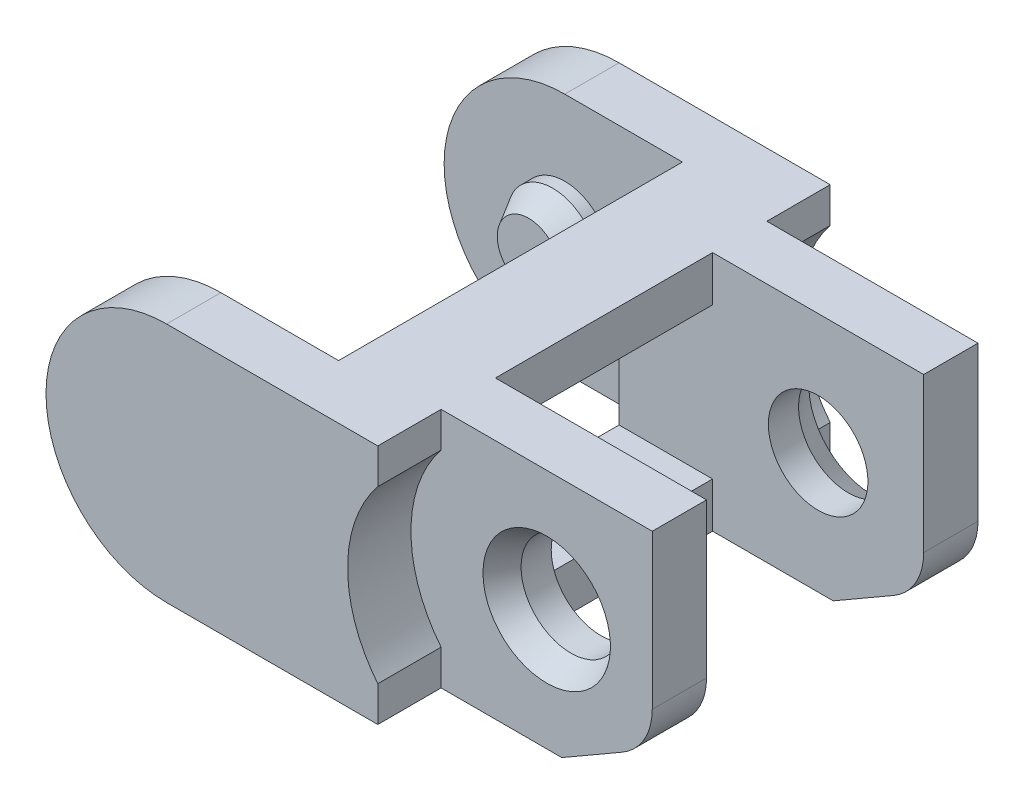
ISO-10303-21;
HEADER;
FILE_DESCRIPTION(('STEP AP214'),'2;1');
FILE_NAME('part.step','',(''),(''),'','','');
FILE_SCHEMA(('AUTOMOTIVE_DESIGN { 1 0 10303 214 1 1 1 1 }'));
ENDSEC;
DATA;
#1=APPLICATION_CONTEXT('core data for automotive mechanical design processes');
#2=APPLICATION_PROTOCOL_DEFINITION('international standard','automotive_design',2000,#1);
#3=PRODUCT_CONTEXT('',#1,'mechanical');
#4=PRODUCT('Part','Part','',(#3));
#5=PRODUCT_RELATED_PRODUCT_CATEGORY('part','',(#4));
#6=PRODUCT_DEFINITION_FORMATION('','',#4);
#7=PRODUCT_DEFINITION_CONTEXT('part definition',#1,'design');
#8=PRODUCT_DEFINITION('design','',#6,#7);
#9=PRODUCT_DEFINITION_SHAPE('','',#8);
#10=(LENGTH_UNIT() NAMED_UNIT(*) SI_UNIT(.MILLI.,.METRE.));
#11=(NAMED_UNIT(*) PLANE_ANGLE_UNIT() SI_UNIT($,.RADIAN.));
#12=(NAMED_UNIT(*) SI_UNIT($,.STERADIAN.) SOLID_ANGLE_UNIT());
#13=UNCERTAINTY_MEASURE_WITH_UNIT(LENGTH_MEASURE(1.E-05),#10,'distance_accuracy_value','');
#14=(GEOMETRIC_REPRESENTATION_CONTEXT(3) GLOBAL_UNCERTAINTY_ASSIGNED_CONTEXT((#13)) GLOBAL_UNIT_ASSIGNED_CONTEXT((#10,
#11,#12)) REPRESENTATION_CONTEXT('',''));
#15=CARTESIAN_POINT('',(0.,0.,0.));
#16=DIRECTION('',(0.,0.,1.));
#17=DIRECTION('',(1.,0.,0.));
#18=AXIS2_PLACEMENT_3D('',#15,#16,#17);
#19=CARTESIAN_POINT('',(0.,-8.,-5.4));
#20=DIRECTION('',(-1.,0.,0.));
#21=DIRECTION('',(0.,0.,1.));
#22=AXIS2_PLACEMENT_3D('',#19,#20,#21);
#23=PLANE('',#22);
#24=DIRECTION('',(0.,0.,-1.));
#25=VECTOR('',#24,1.);
#26=CARTESIAN_POINT('',(0.,-1.17157287525381,-5.4));
#27=LINE('',#26,#25);
#28=CARTESIAN_POINT('',(0.,-1.17157287525381,-7.5));
#29=VERTEX_POINT('',#28);
#30=CARTESIAN_POINT('',(0.,-1.17157287525381,-5.4));
#31=VERTEX_POINT('',#30);
#32=EDGE_CURVE('E223',#29,#31,#27,.F.);
#33=ORIENTED_EDGE('',*,*,#32,.F.);
#34=DIRECTION('',(0.,1.,0.));
#35=VECTOR('',#34,1.);
#36=CARTESIAN_POINT('',(0.,-8.,-7.5));
#37=LINE('',#36,#35);
#38=CARTESIAN_POINT('',(0.,0.,-7.5));
#39=VERTEX_POINT('',#38);
#40=EDGE_CURVE('E250',#29,#39,#37,.T.);
#41=ORIENTED_EDGE('',*,*,#40,.T.);
#42=DIRECTION('',(0.,0.,-1.));
#43=VECTOR('',#42,1.);
#44=CARTESIAN_POINT('',(0.,0.,7.5));
#45=LINE('',#44,#43);
#46=CARTESIAN_POINT('',(0.,0.,-5.4));
#47=VERTEX_POINT('',#46);
#48=EDGE_CURVE('E274',#47,#39,#45,.T.);
#49=ORIENTED_EDGE('',*,*,#48,.F.);
#50=DIRECTION('',(0.,1.,0.));
#51=VECTOR('',#50,1.);
#52=CARTESIAN_POINT('',(0.,-8.,-5.4));
#53=LINE('',#52,#51);
#54=EDGE_CURVE('E243',#31,#47,#53,.T.);
#55=ORIENTED_EDGE('',*,*,#54,.F.);
#56=EDGE_LOOP('',(#33,#41,#49,#55));
#57=FACE_BOUND('',#56,.T.);
#58=ADVANCED_FACE('F32',(#57),#23,.F.);
#59=DIRECTION('',(0.,0.,-1.));
#60=VECTOR('',#59,1.);
#61=CARTESIAN_POINT('',(0.,-6.82842712474619,-5.4));
#62=LINE('',#61,#60);
#63=CARTESIAN_POINT('',(0.,-6.82842712474619,-5.4));
#64=VERTEX_POINT('',#63);
#65=CARTESIAN_POINT('',(0.,-6.82842712474619,-7.5));
#66=VERTEX_POINT('',#65);
#67=EDGE_CURVE('E220',#64,#66,#62,.T.);
#68=ORIENTED_EDGE('',*,*,#67,.F.);
#69=CARTESIAN_POINT('',(0.,-8.,-5.4));
#70=VERTEX_POINT('',#69);
#71=EDGE_CURVE('E233',#70,#64,#53,.T.);
#72=ORIENTED_EDGE('',*,*,#71,.F.);
#73=DIRECTION('',(0.,0.,1.));
#74=VECTOR('',#73,1.);
#75=CARTESIAN_POINT('',(0.,-8.,-5.4));
#76=LINE('',#75,#74);
#77=CARTESIAN_POINT('',(0.,-8.,-7.5));
#78=VERTEX_POINT('',#77);
#79=EDGE_CURVE('E264',#78,#70,#76,.T.);
#80=ORIENTED_EDGE('',*,*,#79,.F.);
#81=EDGE_CURVE('E236',#78,#66,#37,.T.);
#82=ORIENTED_EDGE('',*,*,#81,.T.);
#83=EDGE_LOOP('',(#68,#72,#80,#82));
#84=FACE_BOUND('',#83,.T.);
#85=ADVANCED_FACE('F232',(#84),#23,.F.);
#86=CARTESIAN_POINT('',(0.,-8.,5.4));
#87=DIRECTION('',(-1.,0.,0.));
#88=DIRECTION('',(0.,0.,1.));
#89=AXIS2_PLACEMENT_3D('',#86,#87,#88);
#90=PLANE('',#89);
#91=DIRECTION('',(0.,1.,0.));
#92=VECTOR('',#91,1.);
#93=CARTESIAN_POINT('',(0.,-8.,5.4));
#94=LINE('',#93,#92);
#95=CARTESIAN_POINT('',(0.,-8.,5.4));
#96=VERTEX_POINT('',#95);
#97=CARTESIAN_POINT('',(0.,-6.8284271247462,5.4));
#98=VERTEX_POINT('',#97);
#99=EDGE_CURVE('E576',#96,#98,#94,.T.);
#100=ORIENTED_EDGE('',*,*,#99,.T.);
#101=DIRECTION('',(0.,0.,1.));
#102=VECTOR('',#101,1.);
#103=CARTESIAN_POINT('',(0.,-6.8284271247462,5.4));
#104=LINE('',#103,#102);
#105=CARTESIAN_POINT('',(0.,-6.8284271247462,7.5));
#106=VERTEX_POINT('',#105);
#107=EDGE_CURVE('E237',#98,#106,#104,.T.);
#108=ORIENTED_EDGE('',*,*,#107,.T.);
#109=DIRECTION('',(0.,1.,0.));
#110=VECTOR('',#109,1.);
#111=CARTESIAN_POINT('',(0.,-8.,7.5));
#112=LINE('',#111,#110);
#113=CARTESIAN_POINT('',(0.,-8.,7.5));
#114=VERTEX_POINT('',#113);
#115=EDGE_CURVE('E278',#114,#106,#112,.T.);
#116=ORIENTED_EDGE('',*,*,#115,.F.);
#117=DIRECTION('',(0.,0.,1.));
#118=VECTOR('',#117,1.);
#119=CARTESIAN_POINT('',(0.,-8.,5.4));
#120=LINE('',#119,#118);
#121=EDGE_CURVE('E574',#96,#114,#120,.T.);
#122=ORIENTED_EDGE('',*,*,#121,.F.);
#123=EDGE_LOOP('',(#100,#108,#116,#122));
#124=FACE_BOUND('',#123,.T.);
#125=ADVANCED_FACE('F430',(#124),#90,.F.);
#126=CARTESIAN_POINT('',(0.,-8.,-3.6));
#127=DIRECTION('',(-1.,0.,0.));
#128=DIRECTION('',(0.,0.,1.));
#129=AXIS2_PLACEMENT_3D('',#126,#127,#128);
#130=PLANE('',#129);
#131=DIRECTION('',(0.,1.,0.));
#132=VECTOR('',#131,1.);
#133=CARTESIAN_POINT('',(0.,-8.,3.6));
#134=LINE('',#133,#132);
#135=CARTESIAN_POINT('',(0.,-1.5,3.6));
#136=VERTEX_POINT('',#135);
#137=CARTESIAN_POINT('',(0.,0.,3.6));
#138=VERTEX_POINT('',#137);
#139=EDGE_CURVE('E268',#136,#138,#134,.T.);
#140=ORIENTED_EDGE('',*,*,#139,.F.);
#141=DIRECTION('',(0.,0.,-1.));
#142=VECTOR('',#141,1.);
#143=CARTESIAN_POINT('',(0.,-1.5,-3.6));
#144=LINE('',#143,#142);
#145=CARTESIAN_POINT('',(0.,-1.5,-3.6));
#146=VERTEX_POINT('',#145);
#147=EDGE_CURVE('E632',#136,#146,#144,.T.);
#148=ORIENTED_EDGE('',*,*,#147,.T.);
#149=DIRECTION('',(0.,1.,0.));
#150=VECTOR('',#149,1.);
#151=CARTESIAN_POINT('',(0.,-8.,-3.6));
#152=LINE('',#151,#150);
#153=CARTESIAN_POINT('',(0.,0.,-3.6));
#154=VERTEX_POINT('',#153);
#155=EDGE_CURVE('E272',#146,#154,#152,.T.);
#156=ORIENTED_EDGE('',*,*,#155,.T.);
#157=DIRECTION('',(0.,0.,-1.));
#158=VECTOR('',#157,1.);
#159=CARTESIAN_POINT('',(0.,0.,7.5));
#160=LINE('',#159,#158);
#161=EDGE_CURVE('E353',#138,#154,#160,.T.);
#162=ORIENTED_EDGE('',*,*,#161,.F.);
#163=EDGE_LOOP('',(#140,#148,#156,#162));
#164=FACE_BOUND('',#163,.T.);
#165=ADVANCED_FACE('F444',(#164),#130,.F.);
#166=CARTESIAN_POINT('',(7.,-6.26794919243111,7.5));
#167=DIRECTION('',(-0.500000000000002,0.866025403784438,0.));
#168=DIRECTION('',(-0.866025403784438,-0.500000000000002,0.));
#169=AXIS2_PLACEMENT_3D('',#166,#167,#168);
#170=PLANE('',#169);
#171=DIRECTION('',(0.866025403784438,0.500000000000002,0.));
#172=VECTOR('',#171,1.);
#173=CARTESIAN_POINT('',(7.,-6.26794919243111,3.6));
#174=LINE('',#173,#172);
#175=CARTESIAN_POINT('',(4.,-8.,3.6));
#176=VERTEX_POINT('',#175);
#177=CARTESIAN_POINT('',(6.,-6.84529946162074,3.6));
#178=VERTEX_POINT('',#177);
#179=EDGE_CURVE('E283',#176,#178,#174,.T.);
#180=ORIENTED_EDGE('',*,*,#179,.T.);
#181=DIRECTION('',(0.,0.,-1.));
#182=VECTOR('',#181,1.);
#183=CARTESIAN_POINT('',(6.,-6.84529946162074,7.5));
#184=LINE('',#183,#182);
#185=CARTESIAN_POINT('',(6.,-6.84529946162074,5.4));
#186=VERTEX_POINT('',#185);
#187=EDGE_CURVE('E383',#178,#186,#184,.F.);
#188=ORIENTED_EDGE('',*,*,#187,.T.);
#189=DIRECTION('',(-0.866025403784438,-0.500000000000002,0.));
#190=VECTOR('',#189,1.);
#191=CARTESIAN_POINT('',(7.,-6.26794919243111,5.4));
#192=LINE('',#191,#190);
#193=CARTESIAN_POINT('',(4.,-8.,5.4));
#194=VERTEX_POINT('',#193);
#195=EDGE_CURVE('E288',#186,#194,#192,.T.);
#196=ORIENTED_EDGE('',*,*,#195,.T.);
#197=DIRECTION('',(0.,0.,-1.));
#198=VECTOR('',#197,1.);
#199=CARTESIAN_POINT('',(4.,-8.,7.5));
#200=LINE('',#199,#198);
#201=EDGE_CURVE('E336',#194,#176,#200,.T.);
#202=ORIENTED_EDGE('',*,*,#201,.T.);
#203=EDGE_LOOP('',(#180,#188,#196,#202));
#204=FACE_BOUND('',#203,.T.);
#205=ADVANCED_FACE('F482',(#204),#170,.F.);
#206=CARTESIAN_POINT('',(7.,0.,7.5));
#207=DIRECTION('',(-1.,0.,0.));
#208=DIRECTION('',(0.,-1.,0.));
#209=AXIS2_PLACEMENT_3D('',#206,#207,#208);
#210=PLANE('',#209);
#211=DIRECTION('',(0.,1.,0.));
#212=VECTOR('',#211,1.);
#213=CARTESIAN_POINT('',(7.,-8.,5.4));
#214=LINE('',#213,#212);
#215=CARTESIAN_POINT('',(7.,-5.11324865405187,5.4));
#216=VERTEX_POINT('',#215);
#217=CARTESIAN_POINT('',(7.,0.,5.4));
#218=VERTEX_POINT('',#217);
#219=EDGE_CURVE('E563',#216,#218,#214,.T.);
#220=ORIENTED_EDGE('',*,*,#219,.F.);
#221=DIRECTION('',(0.,0.,-1.));
#222=VECTOR('',#221,1.);
#223=CARTESIAN_POINT('',(7.,-5.11324865405187,7.5));
#224=LINE('',#223,#222);
#225=CARTESIAN_POINT('',(7.,-5.11324865405187,3.6));
#226=VERTEX_POINT('',#225);
#227=EDGE_CURVE('E378',#216,#226,#224,.T.);
#228=ORIENTED_EDGE('',*,*,#227,.T.);
#229=DIRECTION('',(0.,1.,0.));
#230=VECTOR('',#229,1.);
#231=CARTESIAN_POINT('',(7.,-8.,3.6));
#232=LINE('',#231,#230);
#233=CARTESIAN_POINT('',(7.,0.,3.6));
#234=VERTEX_POINT('',#233);
#235=EDGE_CURVE('E262',#226,#234,#232,.T.);
#236=ORIENTED_EDGE('',*,*,#235,.T.);
#237=DIRECTION('',(0.,0.,-1.));
#238=VECTOR('',#237,1.);
#239=CARTESIAN_POINT('',(7.,0.,7.5));
#240=LINE('',#239,#238);
#241=EDGE_CURVE('E332',#218,#234,#240,.T.);
#242=ORIENTED_EDGE('',*,*,#241,.F.);
#243=EDGE_LOOP('',(#220,#228,#236,#242));
#244=FACE_BOUND('',#243,.T.);
#245=ADVANCED_FACE('F478',(#244),#210,.F.);
#246=CARTESIAN_POINT('',(-7.,-4.,7.5));
#247=DIRECTION('',(0.,0.,-1.));
#248=DIRECTION('',(-1.,0.,0.));
#249=AXIS2_PLACEMENT_3D('',#246,#247,#248);
#250=CYLINDRICAL_SURFACE('',#249,4.);
#251=CARTESIAN_POINT('',(-7.,-4.,-5.7));
#252=DIRECTION('',(0.,0.,-1.));
#253=DIRECTION('',(-1.,0.,0.));
#254=AXIS2_PLACEMENT_3D('',#251,#252,#253);
#255=CIRCLE('',#254,4.);
#256=CARTESIAN_POINT('',(-7.,-8.,-5.7));
#257=VERTEX_POINT('',#256);
#258=CARTESIAN_POINT('',(-7.,0.,-5.7));
#259=VERTEX_POINT('',#258);
#260=EDGE_CURVE('E307',#257,#259,#255,.T.);
#261=ORIENTED_EDGE('',*,*,#260,.T.);
#262=DIRECTION('',(0.,0.,-1.));
#263=VECTOR('',#262,1.);
#264=CARTESIAN_POINT('',(-7.,0.,7.5));
#265=LINE('',#264,#263);
#266=CARTESIAN_POINT('',(-7.,0.,-7.5));
#267=VERTEX_POINT('',#266);
#268=EDGE_CURVE('E319',#259,#267,#265,.T.);
#269=ORIENTED_EDGE('',*,*,#268,.T.);
#270=CARTESIAN_POINT('',(-7.,-4.,-7.5));
#271=DIRECTION('',(0.,0.,1.));
#272=DIRECTION('',(1.,0.,0.));
#273=AXIS2_PLACEMENT_3D('',#270,#271,#272);
#274=CIRCLE('',#273,4.);
#275=CARTESIAN_POINT('',(-7.,-8.,-7.5));
#276=VERTEX_POINT('',#275);
#277=EDGE_CURVE('E309',#267,#276,#274,.T.);
#278=ORIENTED_EDGE('',*,*,#277,.T.);
#279=DIRECTION('',(0.,0.,-1.));
#280=VECTOR('',#279,1.);
#281=CARTESIAN_POINT('',(-7.,-8.,7.5));
#282=LINE('',#281,#280);
#283=EDGE_CURVE('E341',#257,#276,#282,.T.);
#284=ORIENTED_EDGE('',*,*,#283,.F.);
#285=EDGE_LOOP('',(#261,#269,#278,#284));
#286=FACE_BOUND('',#285,.T.);
#287=ADVANCED_FACE('F489',(#286),#250,.T.);
#288=CARTESIAN_POINT('',(-7.,0.,7.5));
#289=VERTEX_POINT('',#288);
#290=CARTESIAN_POINT('',(-7.,0.,5.7));
#291=VERTEX_POINT('',#290);
#292=EDGE_CURVE('E326',#289,#291,#265,.T.);
#293=ORIENTED_EDGE('',*,*,#292,.T.);
#294=CARTESIAN_POINT('',(-7.,-4.,5.7));
#295=DIRECTION('',(0.,0.,1.));
#296=DIRECTION('',(1.,0.,0.));
#297=AXIS2_PLACEMENT_3D('',#294,#295,#296);
#298=CIRCLE('',#297,4.);
#299=CARTESIAN_POINT('',(-7.,-8.,5.7));
#300=VERTEX_POINT('',#299);
#301=EDGE_CURVE('E303',#291,#300,#298,.T.);
#302=ORIENTED_EDGE('',*,*,#301,.T.);
#303=CARTESIAN_POINT('',(-7.,-8.,7.5));
#304=VERTEX_POINT('',#303);
#305=EDGE_CURVE('E337',#304,#300,#282,.T.);
#306=ORIENTED_EDGE('',*,*,#305,.F.);
#307=CARTESIAN_POINT('',(-7.,-4.,7.5));
#308=DIRECTION('',(0.,0.,1.));
#309=DIRECTION('',(1.,0.,0.));
#310=AXIS2_PLACEMENT_3D('',#307,#308,#309);
#311=CIRCLE('',#310,4.);
#312=EDGE_CURVE('E310',#289,#304,#311,.T.);
#313=ORIENTED_EDGE('',*,*,#312,.F.);
#314=EDGE_LOOP('',(#293,#302,#306,#313));
#315=FACE_BOUND('',#314,.T.);
#316=ADVANCED_FACE('F485',(#315),#250,.T.);
#317=CARTESIAN_POINT('',(4.,-8.,7.5));
#318=DIRECTION('',(0.,1.,0.));
#319=DIRECTION('',(0.,0.,1.));
#320=AXIS2_PLACEMENT_3D('',#317,#318,#319);
#321=PLANE('',#320);
#322=DIRECTION('',(-1.,0.,0.));
#323=VECTOR('',#322,1.);
#324=CARTESIAN_POINT('',(7.,-8.,5.4));
#325=LINE('',#324,#323);
#326=EDGE_CURVE('E245',#194,#96,#325,.T.);
#327=ORIENTED_EDGE('',*,*,#326,.T.);
#328=ORIENTED_EDGE('',*,*,#121,.T.);
#329=DIRECTION('',(1.,0.,0.));
#330=VECTOR('',#329,1.);
#331=CARTESIAN_POINT('',(4.,-8.,7.5));
#332=LINE('',#331,#330);
#333=EDGE_CURVE('E313',#304,#114,#332,.T.);
#334=ORIENTED_EDGE('',*,*,#333,.F.);
#335=ORIENTED_EDGE('',*,*,#305,.T.);
#336=DIRECTION('',(1.,0.,0.));
#337=VECTOR('',#336,1.);
#338=CARTESIAN_POINT('',(-3.1,-8.,5.7));
#339=LINE('',#338,#337);
#340=CARTESIAN_POINT('',(-3.1,-8.,5.7));
#341=VERTEX_POINT('',#340);
#342=EDGE_CURVE('E290',#300,#341,#339,.T.);
#343=ORIENTED_EDGE('',*,*,#342,.T.);
#344=DIRECTION('',(0.,0.,-1.));
#345=VECTOR('',#344,1.);
#346=CARTESIAN_POINT('',(-3.1,-8.,-5.7));
#347=LINE('',#346,#345);
#348=CARTESIAN_POINT('',(-3.1,-8.,-5.7));
#349=VERTEX_POINT('',#348);
#350=EDGE_CURVE('E293',#341,#349,#347,.T.);
#351=ORIENTED_EDGE('',*,*,#350,.T.);
#352=DIRECTION('',(-1.,0.,0.));
#353=VECTOR('',#352,1.);
#354=CARTESIAN_POINT('',(-11.,-8.,-5.7));
#355=LINE('',#354,#353);
#356=EDGE_CURVE('E296',#349,#257,#355,.T.);
#357=ORIENTED_EDGE('',*,*,#356,.T.);
#358=ORIENTED_EDGE('',*,*,#283,.T.);
#359=DIRECTION('',(1.,0.,0.));
#360=VECTOR('',#359,1.);
#361=CARTESIAN_POINT('',(4.,-8.,-7.5));
#362=LINE('',#361,#360);
#363=EDGE_CURVE('E322',#276,#78,#362,.T.);
#364=ORIENTED_EDGE('',*,*,#363,.T.);
#365=ORIENTED_EDGE('',*,*,#79,.T.);
#366=DIRECTION('',(1.,0.,0.));
#367=VECTOR('',#366,1.);
#368=CARTESIAN_POINT('',(7.,-8.,-5.4));
#369=LINE('',#368,#367);
#370=CARTESIAN_POINT('',(4.,-8.,-5.4));
#371=VERTEX_POINT('',#370);
#372=EDGE_CURVE('E240',#70,#371,#369,.T.);
#373=ORIENTED_EDGE('',*,*,#372,.T.);
#374=CARTESIAN_POINT('',(4.,-8.,-3.6));
#375=VERTEX_POINT('',#374);
#376=EDGE_CURVE('E333',#375,#371,#200,.T.);
#377=ORIENTED_EDGE('',*,*,#376,.F.);
#378=DIRECTION('',(-1.,0.,0.));
#379=VECTOR('',#378,1.);
#380=CARTESIAN_POINT('',(7.,-8.,-3.6));
#381=LINE('',#380,#379);
#382=CARTESIAN_POINT('',(0.,-8.,-3.6));
#383=VERTEX_POINT('',#382);
#384=EDGE_CURVE('E251',#375,#383,#381,.T.);
#385=ORIENTED_EDGE('',*,*,#384,.T.);
#386=DIRECTION('',(0.,0.,1.));
#387=VECTOR('',#386,1.);
#388=CARTESIAN_POINT('',(0.,-8.,-3.6));
#389=LINE('',#388,#387);
#390=CARTESIAN_POINT('',(0.,-8.,3.6));
#391=VERTEX_POINT('',#390);
#392=EDGE_CURVE('E254',#383,#391,#389,.T.);
#393=ORIENTED_EDGE('',*,*,#392,.T.);
#394=DIRECTION('',(1.,0.,0.));
#395=VECTOR('',#394,1.);
#396=CARTESIAN_POINT('',(7.,-8.,3.6));
#397=LINE('',#396,#395);
#398=EDGE_CURVE('E258',#391,#176,#397,.T.);
#399=ORIENTED_EDGE('',*,*,#398,.T.);
#400=ORIENTED_EDGE('',*,*,#201,.F.);
#401=EDGE_LOOP('',(#327,#328,#334,#335,#343,#351,#357,#358,#364,#365,#373,#377,#385,#393,#399,#400));
#402=FACE_BOUND('',#401,.T.);
#403=ADVANCED_FACE('F481',(#402),#321,.F.);
#404=DIRECTION('',(0.866025403784438,0.500000000000002,0.));
#405=VECTOR('',#404,1.);
#406=CARTESIAN_POINT('',(7.,-6.26794919243112,-5.4));
#407=LINE('',#406,#405);
#408=CARTESIAN_POINT('',(6.,-6.84529946162074,-5.4));
#409=VERTEX_POINT('',#408);
#410=EDGE_CURVE('E286',#371,#409,#407,.T.);
#411=ORIENTED_EDGE('',*,*,#410,.T.);
#412=DIRECTION('',(0.,0.,-1.));
#413=VECTOR('',#412,1.);
#414=CARTESIAN_POINT('',(6.,-6.84529946162074,7.5));
#415=LINE('',#414,#413);
#416=CARTESIAN_POINT('',(6.,-6.84529946162074,-3.6));
#417=VERTEX_POINT('',#416);
#418=EDGE_CURVE('E47',#409,#417,#415,.F.);
#419=ORIENTED_EDGE('',*,*,#418,.T.);
#420=DIRECTION('',(-0.866025403784438,-0.500000000000002,0.));
#421=VECTOR('',#420,1.);
#422=CARTESIAN_POINT('',(7.,-6.26794919243112,-3.6));
#423=LINE('',#422,#421);
#424=EDGE_CURVE('E281',#417,#375,#423,.T.);
#425=ORIENTED_EDGE('',*,*,#424,.T.);
#426=ORIENTED_EDGE('',*,*,#376,.T.);
#427=EDGE_LOOP('',(#411,#419,#425,#426));
#428=FACE_BOUND('',#427,.T.);
#429=ADVANCED_FACE('F476',(#428),#170,.F.);
#430=DIRECTION('',(0.,1.,0.));
#431=VECTOR('',#430,1.);
#432=CARTESIAN_POINT('',(7.,-8.,-3.6));
#433=LINE('',#432,#431);
#434=CARTESIAN_POINT('',(7.,-5.11324865405187,-3.6));
#435=VERTEX_POINT('',#434);
#436=CARTESIAN_POINT('',(7.,0.,-3.6));
#437=VERTEX_POINT('',#436);
#438=EDGE_CURVE('E261',#435,#437,#433,.T.);
#439=ORIENTED_EDGE('',*,*,#438,.F.);
#440=DIRECTION('',(0.,0.,-1.));
#441=VECTOR('',#440,1.);
#442=CARTESIAN_POINT('',(7.,-5.11324865405187,7.5));
#443=LINE('',#442,#441);
#444=CARTESIAN_POINT('',(7.,-5.11324865405187,-5.4));
#445=VERTEX_POINT('',#444);
#446=EDGE_CURVE('E387',#435,#445,#443,.T.);
#447=ORIENTED_EDGE('',*,*,#446,.T.);
#448=DIRECTION('',(0.,1.,0.));
#449=VECTOR('',#448,1.);
#450=CARTESIAN_POINT('',(7.,-8.,-5.4));
#451=LINE('',#450,#449);
#452=CARTESIAN_POINT('',(7.,0.,-5.4));
#453=VERTEX_POINT('',#452);
#454=EDGE_CURVE('E242',#445,#453,#451,.T.);
#455=ORIENTED_EDGE('',*,*,#454,.T.);
#456=EDGE_CURVE('E329',#437,#453,#240,.T.);
#457=ORIENTED_EDGE('',*,*,#456,.F.);
#458=EDGE_LOOP('',(#439,#447,#455,#457));
#459=FACE_BOUND('',#458,.T.);
#460=ADVANCED_FACE('F472',(#459),#210,.F.);
#461=CARTESIAN_POINT('',(-7.,0.,7.5));
#462=DIRECTION('',(0.,-1.,0.));
#463=DIRECTION('',(1.,0.,0.));
#464=AXIS2_PLACEMENT_3D('',#461,#462,#463);
#465=PLANE('',#464);
#466=DIRECTION('',(-1.,0.,0.));
#467=VECTOR('',#466,1.);
#468=CARTESIAN_POINT('',(-7.,0.,7.5));
#469=LINE('',#468,#467);
#470=CARTESIAN_POINT('',(0.,0.,7.5));
#471=VERTEX_POINT('',#470);
#472=EDGE_CURVE('E317',#471,#289,#469,.T.);
#473=ORIENTED_EDGE('',*,*,#472,.F.);
#474=DIRECTION('',(0.,0.,-1.));
#475=VECTOR('',#474,1.);
#476=CARTESIAN_POINT('',(0.,0.,7.5));
#477=LINE('',#476,#475);
#478=CARTESIAN_POINT('',(0.,0.,5.4));
#479=VERTEX_POINT('',#478);
#480=EDGE_CURVE('E277',#471,#479,#477,.T.);
#481=ORIENTED_EDGE('',*,*,#480,.T.);
#482=DIRECTION('',(1.,0.,0.));
#483=VECTOR('',#482,1.);
#484=CARTESIAN_POINT('',(-7.,0.,5.4));
#485=LINE('',#484,#483);
#486=EDGE_CURVE('E361',#479,#218,#485,.T.);
#487=ORIENTED_EDGE('',*,*,#486,.T.);
#488=ORIENTED_EDGE('',*,*,#241,.T.);
#489=DIRECTION('',(-1.,0.,0.));
#490=VECTOR('',#489,1.);
#491=CARTESIAN_POINT('',(-7.,0.,3.6));
#492=LINE('',#491,#490);
#493=EDGE_CURVE('E356',#234,#138,#492,.T.);
#494=ORIENTED_EDGE('',*,*,#493,.T.);
#495=ORIENTED_EDGE('',*,*,#161,.T.);
#496=DIRECTION('',(1.,0.,0.));
#497=VECTOR('',#496,1.);
#498=CARTESIAN_POINT('',(-7.,0.,-3.6));
#499=LINE('',#498,#497);
#500=EDGE_CURVE('E350',#154,#437,#499,.T.);
#501=ORIENTED_EDGE('',*,*,#500,.T.);
#502=ORIENTED_EDGE('',*,*,#456,.T.);
#503=DIRECTION('',(-1.,0.,0.));
#504=VECTOR('',#503,1.);
#505=CARTESIAN_POINT('',(-7.,0.,-5.4));
#506=LINE('',#505,#504);
#507=EDGE_CURVE('E359',#453,#47,#506,.T.);
#508=ORIENTED_EDGE('',*,*,#507,.T.);
#509=ORIENTED_EDGE('',*,*,#48,.T.);
#510=DIRECTION('',(-1.,0.,0.));
#511=VECTOR('',#510,1.);
#512=CARTESIAN_POINT('',(-7.,0.,-7.5));
#513=LINE('',#512,#511);
#514=EDGE_CURVE('E314',#39,#267,#513,.T.);
#515=ORIENTED_EDGE('',*,*,#514,.T.);
#516=ORIENTED_EDGE('',*,*,#268,.F.);
#517=DIRECTION('',(1.,0.,0.));
#518=VECTOR('',#517,1.);
#519=CARTESIAN_POINT('',(-7.,0.,-5.7));
#520=LINE('',#519,#518);
#521=CARTESIAN_POINT('',(-3.1,0.,-5.7));
#522=VERTEX_POINT('',#521);
#523=EDGE_CURVE('E347',#259,#522,#520,.T.);
#524=ORIENTED_EDGE('',*,*,#523,.T.);
#525=DIRECTION('',(0.,0.,1.));
#526=VECTOR('',#525,1.);
#527=CARTESIAN_POINT('',(-3.1,0.,7.5));
#528=LINE('',#527,#526);
#529=CARTESIAN_POINT('',(-3.1,0.,5.7));
#530=VERTEX_POINT('',#529);
#531=EDGE_CURVE('E344',#522,#530,#528,.T.);
#532=ORIENTED_EDGE('',*,*,#531,.T.);
#533=DIRECTION('',(-1.,0.,0.));
#534=VECTOR('',#533,1.);
#535=CARTESIAN_POINT('',(-7.,0.,5.7));
#536=LINE('',#535,#534);
#537=EDGE_CURVE('E340',#530,#291,#536,.T.);
#538=ORIENTED_EDGE('',*,*,#537,.T.);
#539=ORIENTED_EDGE('',*,*,#292,.F.);
#540=EDGE_LOOP('',(#473,#481,#487,#488,#494,#495,#501,#502,#508,#509,#515,#516,#524,#532,#538,#539));
#541=FACE_BOUND('',#540,.T.);
#542=ADVANCED_FACE('F465',(#541),#465,.F.);
#543=CARTESIAN_POINT('',(-7.,-4.,7.5));
#544=DIRECTION('',(0.,0.,1.));
#545=DIRECTION('',(1.,0.,0.));
#546=AXIS2_PLACEMENT_3D('',#543,#544,#545);
#547=PLANE('',#546);
#548=CARTESIAN_POINT('',(3.5,-4.,7.5));
#549=DIRECTION('',(0.,0.,1.));
#550=DIRECTION('',(1.,0.,0.));
#551=AXIS2_PLACEMENT_3D('',#548,#549,#550);
#552=CIRCLE('',#551,4.5);
#553=CARTESIAN_POINT('',(0.,-1.1715728752538,7.5));
#554=VERTEX_POINT('',#553);
#555=EDGE_CURVE('E607',#554,#106,#552,.T.);
#556=ORIENTED_EDGE('',*,*,#555,.F.);
#557=EDGE_CURVE('E606',#554,#471,#112,.T.);
#558=ORIENTED_EDGE('',*,*,#557,.T.);
#559=ORIENTED_EDGE('',*,*,#472,.T.);
#560=ORIENTED_EDGE('',*,*,#312,.T.);
#561=ORIENTED_EDGE('',*,*,#333,.T.);
#562=ORIENTED_EDGE('',*,*,#115,.T.);
#563=EDGE_LOOP('',(#556,#558,#559,#560,#561,#562));
#564=FACE_BOUND('',#563,.T.);
#565=ADVANCED_FACE('F462',(#564),#547,.T.);
#566=CARTESIAN_POINT('',(-7.,-4.,-7.5));
#567=DIRECTION('',(0.,0.,1.));
#568=DIRECTION('',(1.,0.,0.));
#569=AXIS2_PLACEMENT_3D('',#566,#567,#568);
#570=PLANE('',#569);
#571=CARTESIAN_POINT('',(3.5,-4.,-7.5));
#572=DIRECTION('',(0.,0.,1.));
#573=DIRECTION('',(1.,0.,0.));
#574=AXIS2_PLACEMENT_3D('',#571,#572,#573);
#575=CIRCLE('',#574,4.5);
#576=EDGE_CURVE('E228',#29,#66,#575,.T.);
#577=ORIENTED_EDGE('',*,*,#576,.T.);
#578=ORIENTED_EDGE('',*,*,#81,.F.);
#579=ORIENTED_EDGE('',*,*,#363,.F.);
#580=ORIENTED_EDGE('',*,*,#277,.F.);
#581=ORIENTED_EDGE('',*,*,#514,.F.);
#582=ORIENTED_EDGE('',*,*,#40,.F.);
#583=EDGE_LOOP('',(#577,#578,#579,#580,#581,#582));
#584=FACE_BOUND('',#583,.T.);
#585=ADVANCED_FACE('F453',(#584),#570,.F.);
#586=CARTESIAN_POINT('',(-11.,-8.,-5.7));
#587=DIRECTION('',(0.,0.,-1.));
#588=DIRECTION('',(-1.,0.,0.));
#589=AXIS2_PLACEMENT_3D('',#586,#587,#588);
#590=PLANE('',#589);
#591=CARTESIAN_POINT('',(-6.99999999999999,-4.,-5.7));
#592=DIRECTION('',(0.,0.,-1.));
#593=DIRECTION('',(-1.,0.,0.));
#594=AXIS2_PLACEMENT_3D('',#591,#592,#593);
#595=CIRCLE('',#594,1.5);
#596=CARTESIAN_POINT('',(-8.49999999999999,-4.,-5.7));
#597=VERTEX_POINT('',#596);
#598=EDGE_CURVE('E227',#597,#597,#595,.T.);
#599=ORIENTED_EDGE('',*,*,#598,.T.);
#600=EDGE_LOOP('',(#599));
#601=FACE_BOUND('',#600,.T.);
#602=ORIENTED_EDGE('',*,*,#356,.F.);
#603=DIRECTION('',(0.,1.,0.));
#604=VECTOR('',#603,1.);
#605=CARTESIAN_POINT('',(-3.1,-8.,-5.7));
#606=LINE('',#605,#604);
#607=EDGE_CURVE('E300',#349,#522,#606,.T.);
#608=ORIENTED_EDGE('',*,*,#607,.T.);
#609=ORIENTED_EDGE('',*,*,#523,.F.);
#610=ORIENTED_EDGE('',*,*,#260,.F.);
#611=EDGE_LOOP('',(#602,#608,#609,#610));
#612=FACE_BOUND('',#611,.T.);
#613=ADVANCED_FACE('F449',(#601,#612),#590,.F.);
#614=CARTESIAN_POINT('',(-3.1,-8.,-5.7));
#615=DIRECTION('',(1.,0.,0.));
#616=DIRECTION('',(0.,0.,-1.));
#617=AXIS2_PLACEMENT_3D('',#614,#615,#616);
#618=PLANE('',#617);
#619=DIRECTION('',(0.,0.,1.));
#620=VECTOR('',#619,1.);
#621=CARTESIAN_POINT('',(-3.1,-1.5,-5.7));
#622=LINE('',#621,#620);
#623=CARTESIAN_POINT('',(-3.1,-1.5,-3.6));
#624=VERTEX_POINT('',#623);
#625=CARTESIAN_POINT('',(-3.1,-1.5,3.6));
#626=VERTEX_POINT('',#625);
#627=EDGE_CURVE('E635',#624,#626,#622,.T.);
#628=ORIENTED_EDGE('',*,*,#627,.T.);
#629=DIRECTION('',(0.,-1.,0.));
#630=VECTOR('',#629,1.);
#631=CARTESIAN_POINT('',(-3.1,-8.,3.6));
#632=LINE('',#631,#630);
#633=CARTESIAN_POINT('',(-3.1,-6.5,3.6));
#634=VERTEX_POINT('',#633);
#635=EDGE_CURVE('E255',#626,#634,#632,.T.);
#636=ORIENTED_EDGE('',*,*,#635,.T.);
#637=DIRECTION('',(0.,0.,-1.));
#638=VECTOR('',#637,1.);
#639=CARTESIAN_POINT('',(-3.1,-6.5,-5.7));
#640=LINE('',#639,#638);
#641=CARTESIAN_POINT('',(-3.1,-6.5,-3.6));
#642=VERTEX_POINT('',#641);
#643=EDGE_CURVE('E629',#634,#642,#640,.T.);
#644=ORIENTED_EDGE('',*,*,#643,.T.);
#645=DIRECTION('',(0.,1.,0.));
#646=VECTOR('',#645,1.);
#647=CARTESIAN_POINT('',(-3.1,-8.,-3.6));
#648=LINE('',#647,#646);
#649=EDGE_CURVE('E638',#642,#624,#648,.T.);
#650=ORIENTED_EDGE('',*,*,#649,.T.);
#651=EDGE_LOOP('',(#628,#636,#644,#650));
#652=FACE_BOUND('',#651,.T.);
#653=ORIENTED_EDGE('',*,*,#607,.F.);
#654=ORIENTED_EDGE('',*,*,#350,.F.);
#655=DIRECTION('',(0.,1.,0.));
#656=VECTOR('',#655,1.);
#657=CARTESIAN_POINT('',(-3.1,-8.,5.7));
#658=LINE('',#657,#656);
#659=EDGE_CURVE('E299',#341,#530,#658,.T.);
#660=ORIENTED_EDGE('',*,*,#659,.T.);
#661=ORIENTED_EDGE('',*,*,#531,.F.);
#662=EDGE_LOOP('',(#653,#654,#660,#661));
#663=FACE_BOUND('',#662,.T.);
#664=ADVANCED_FACE('F452',(#652,#663),#618,.F.);
#665=CARTESIAN_POINT('',(-3.1,-8.,5.7));
#666=DIRECTION('',(0.,0.,1.));
#667=DIRECTION('',(1.,0.,0.));
#668=AXIS2_PLACEMENT_3D('',#665,#666,#667);
#669=PLANE('',#668);
#670=CARTESIAN_POINT('',(-6.99999999999999,-4.,5.7));
#671=DIRECTION('',(0.,0.,1.));
#672=DIRECTION('',(1.,0.,0.));
#673=AXIS2_PLACEMENT_3D('',#670,#671,#672);
#674=CIRCLE('',#673,1.5);
#675=CARTESIAN_POINT('',(-5.49999999999999,-4.,5.7));
#676=VERTEX_POINT('',#675);
#677=EDGE_CURVE('E364',#676,#676,#674,.F.);
#678=ORIENTED_EDGE('',*,*,#677,.F.);
#679=EDGE_LOOP('',(#678));
#680=FACE_BOUND('',#679,.T.);
#681=ORIENTED_EDGE('',*,*,#301,.F.);
#682=ORIENTED_EDGE('',*,*,#537,.F.);
#683=ORIENTED_EDGE('',*,*,#659,.F.);
#684=ORIENTED_EDGE('',*,*,#342,.F.);
#685=EDGE_LOOP('',(#681,#682,#683,#684));
#686=FACE_BOUND('',#685,.T.);
#687=ADVANCED_FACE('F457',(#680,#686),#669,.F.);
#688=CARTESIAN_POINT('',(7.,-8.,-5.4));
#689=DIRECTION('',(0.,0.,1.));
#690=DIRECTION('',(1.,0.,0.));
#691=AXIS2_PLACEMENT_3D('',#688,#689,#690);
#692=PLANE('',#691);
#693=CARTESIAN_POINT('',(3.5,-4.,-5.4));
#694=DIRECTION('',(0.,0.,1.));
#695=DIRECTION('',(1.,0.,0.));
#696=AXIS2_PLACEMENT_3D('',#693,#694,#695);
#697=CIRCLE('',#696,2.11188021535169);
#698=CARTESIAN_POINT('',(5.61188021535169,-4.,-5.4));
#699=VERTEX_POINT('',#698);
#700=EDGE_CURVE('E40',#699,#699,#697,.T.);
#701=ORIENTED_EDGE('',*,*,#700,.T.);
#702=EDGE_LOOP('',(#701));
#703=FACE_BOUND('',#702,.T.);
#704=ORIENTED_EDGE('',*,*,#454,.F.);
#705=CARTESIAN_POINT('',(5.,-5.11324865405187,-5.4));
#706=DIRECTION('',(0.,0.,1.));
#707=DIRECTION('',(1.,0.,0.));
#708=AXIS2_PLACEMENT_3D('',#705,#706,#707);
#709=CIRCLE('',#708,2.);
#710=EDGE_CURVE('E55',#445,#409,#709,.F.);
#711=ORIENTED_EDGE('',*,*,#710,.T.);
#712=ORIENTED_EDGE('',*,*,#410,.F.);
#713=ORIENTED_EDGE('',*,*,#372,.F.);
#714=ORIENTED_EDGE('',*,*,#71,.T.);
#715=CARTESIAN_POINT('',(3.5,-4.,-5.4));
#716=DIRECTION('',(0.,0.,1.));
#717=DIRECTION('',(1.,0.,0.));
#718=AXIS2_PLACEMENT_3D('',#715,#716,#717);
#719=CIRCLE('',#718,4.5);
#720=EDGE_CURVE('E217',#31,#64,#719,.T.);
#721=ORIENTED_EDGE('',*,*,#720,.F.);
#722=ORIENTED_EDGE('',*,*,#54,.T.);
#723=ORIENTED_EDGE('',*,*,#507,.F.);
#724=EDGE_LOOP('',(#704,#711,#712,#713,#714,#721,#722,#723));
#725=FACE_BOUND('',#724,.T.);
#726=ADVANCED_FACE('F239',(#703,#725),#692,.F.);
#727=CARTESIAN_POINT('',(7.,-8.,5.4));
#728=DIRECTION('',(0.,0.,-1.));
#729=DIRECTION('',(-1.,0.,0.));
#730=AXIS2_PLACEMENT_3D('',#727,#728,#729);
#731=PLANE('',#730);
#732=CARTESIAN_POINT('',(3.5,-4.,5.4));
#733=DIRECTION('',(0.,0.,-1.));
#734=DIRECTION('',(-1.,0.,0.));
#735=AXIS2_PLACEMENT_3D('',#732,#733,#734);
#736=CIRCLE('',#735,2.11188021535169);
#737=CARTESIAN_POINT('',(1.38811978464831,-4.,5.4));
#738=VERTEX_POINT('',#737);
#739=EDGE_CURVE('E406',#738,#738,#736,.T.);
#740=ORIENTED_EDGE('',*,*,#739,.T.);
#741=EDGE_LOOP('',(#740));
#742=FACE_BOUND('',#741,.T.);
#743=ORIENTED_EDGE('',*,*,#195,.F.);
#744=CARTESIAN_POINT('',(5.,-5.11324865405187,5.4));
#745=DIRECTION('',(0.,0.,-1.));
#746=DIRECTION('',(-1.,0.,0.));
#747=AXIS2_PLACEMENT_3D('',#744,#745,#746);
#748=CIRCLE('',#747,2.);
#749=EDGE_CURVE('E385',#186,#216,#748,.F.);
#750=ORIENTED_EDGE('',*,*,#749,.T.);
#751=ORIENTED_EDGE('',*,*,#219,.T.);
#752=ORIENTED_EDGE('',*,*,#486,.F.);
#753=CARTESIAN_POINT('',(0.,-1.1715728752538,5.4));
#754=VERTEX_POINT('',#753);
#755=EDGE_CURVE('E573',#754,#479,#94,.T.);
#756=ORIENTED_EDGE('',*,*,#755,.F.);
#757=CARTESIAN_POINT('',(3.5,-4.,5.4));
#758=DIRECTION('',(0.,0.,1.));
#759=DIRECTION('',(1.,0.,0.));
#760=AXIS2_PLACEMENT_3D('',#757,#758,#759);
#761=CIRCLE('',#760,4.5);
#762=EDGE_CURVE('E369',#754,#98,#761,.T.);
#763=ORIENTED_EDGE('',*,*,#762,.T.);
#764=ORIENTED_EDGE('',*,*,#99,.F.);
#765=ORIENTED_EDGE('',*,*,#326,.F.);
#766=EDGE_LOOP('',(#743,#750,#751,#752,#756,#763,#764,#765));
#767=FACE_BOUND('',#766,.T.);
#768=ADVANCED_FACE('F540',(#742,#767),#731,.F.);
#769=ORIENTED_EDGE('',*,*,#557,.F.);
#770=DIRECTION('',(0.,0.,1.));
#771=VECTOR('',#770,1.);
#772=CARTESIAN_POINT('',(0.,-1.1715728752538,5.4));
#773=LINE('',#772,#771);
#774=EDGE_CURVE('E372',#554,#754,#773,.F.);
#775=ORIENTED_EDGE('',*,*,#774,.T.);
#776=ORIENTED_EDGE('',*,*,#755,.T.);
#777=ORIENTED_EDGE('',*,*,#480,.F.);
#778=EDGE_LOOP('',(#769,#775,#776,#777));
#779=FACE_BOUND('',#778,.T.);
#780=ADVANCED_FACE('F438',(#779),#90,.F.);
#781=CARTESIAN_POINT('',(7.,-8.,3.6));
#782=DIRECTION('',(0.,0.,1.));
#783=DIRECTION('',(1.,0.,0.));
#784=AXIS2_PLACEMENT_3D('',#781,#782,#783);
#785=PLANE('',#784);
#786=CARTESIAN_POINT('',(3.5,-4.,3.6));
#787=DIRECTION('',(0.,0.,1.));
#788=DIRECTION('',(1.,0.,0.));
#789=AXIS2_PLACEMENT_3D('',#786,#787,#788);
#790=CIRCLE('',#789,1.65);
#791=CARTESIAN_POINT('',(5.15,-4.,3.6));
#792=VERTEX_POINT('',#791);
#793=EDGE_CURVE('E368',#792,#792,#790,.T.);
#794=ORIENTED_EDGE('',*,*,#793,.T.);
#795=EDGE_LOOP('',(#794));
#796=FACE_BOUND('',#795,.T.);
#797=ORIENTED_EDGE('',*,*,#235,.F.);
#798=CARTESIAN_POINT('',(5.,-5.11324865405187,3.6));
#799=DIRECTION('',(0.,0.,1.));
#800=DIRECTION('',(1.,0.,0.));
#801=AXIS2_PLACEMENT_3D('',#798,#799,#800);
#802=CIRCLE('',#801,2.);
#803=EDGE_CURVE('E381',#226,#178,#802,.F.);
#804=ORIENTED_EDGE('',*,*,#803,.T.);
#805=ORIENTED_EDGE('',*,*,#179,.F.);
#806=ORIENTED_EDGE('',*,*,#398,.F.);
#807=CARTESIAN_POINT('',(0.,-6.5,3.6));
#808=VERTEX_POINT('',#807);
#809=EDGE_CURVE('E265',#391,#808,#134,.T.);
#810=ORIENTED_EDGE('',*,*,#809,.T.);
#811=DIRECTION('',(1.,0.,0.));
#812=VECTOR('',#811,1.);
#813=CARTESIAN_POINT('',(-11.,-6.5,3.6));
#814=LINE('',#813,#812);
#815=EDGE_CURVE('E617',#634,#808,#814,.T.);
#816=ORIENTED_EDGE('',*,*,#815,.F.);
#817=ORIENTED_EDGE('',*,*,#635,.F.);
#818=DIRECTION('',(1.,0.,0.));
#819=VECTOR('',#818,1.);
#820=CARTESIAN_POINT('',(-11.,-1.5,3.6));
#821=LINE('',#820,#819);
#822=EDGE_CURVE('E618',#626,#136,#821,.T.);
#823=ORIENTED_EDGE('',*,*,#822,.T.);
#824=ORIENTED_EDGE('',*,*,#139,.T.);
#825=ORIENTED_EDGE('',*,*,#493,.F.);
#826=EDGE_LOOP('',(#797,#804,#805,#806,#810,#816,#817,#823,#824,#825));
#827=FACE_BOUND('',#826,.T.);
#828=ADVANCED_FACE('F434',(#796,#827),#785,.F.);
#829=CARTESIAN_POINT('',(0.,-6.5,-3.6));
#830=VERTEX_POINT('',#829);
#831=EDGE_CURVE('E269',#383,#830,#152,.T.);
#832=ORIENTED_EDGE('',*,*,#831,.T.);
#833=DIRECTION('',(0.,0.,1.));
#834=VECTOR('',#833,1.);
#835=CARTESIAN_POINT('',(0.,-6.5,-3.6));
#836=LINE('',#835,#834);
#837=EDGE_CURVE('E620',#830,#808,#836,.T.);
#838=ORIENTED_EDGE('',*,*,#837,.T.);
#839=ORIENTED_EDGE('',*,*,#809,.F.);
#840=ORIENTED_EDGE('',*,*,#392,.F.);
#841=EDGE_LOOP('',(#832,#838,#839,#840));
#842=FACE_BOUND('',#841,.T.);
#843=ADVANCED_FACE('F437',(#842),#130,.F.);
#844=CARTESIAN_POINT('',(7.,-8.,-3.6));
#845=DIRECTION('',(0.,0.,-1.));
#846=DIRECTION('',(-1.,0.,0.));
#847=AXIS2_PLACEMENT_3D('',#844,#845,#846);
#848=PLANE('',#847);
#849=CARTESIAN_POINT('',(3.5,-4.,-3.6));
#850=DIRECTION('',(0.,0.,-1.));
#851=DIRECTION('',(-1.,0.,0.));
#852=AXIS2_PLACEMENT_3D('',#849,#850,#851);
#853=CIRCLE('',#852,1.65);
#854=CARTESIAN_POINT('',(1.85,-4.,-3.6));
#855=VERTEX_POINT('',#854);
#856=EDGE_CURVE('E365',#855,#855,#853,.T.);
#857=ORIENTED_EDGE('',*,*,#856,.T.);
#858=EDGE_LOOP('',(#857));
#859=FACE_BOUND('',#858,.T.);
#860=ORIENTED_EDGE('',*,*,#424,.F.);
#861=CARTESIAN_POINT('',(5.,-5.11324865405187,-3.6));
#862=DIRECTION('',(0.,0.,-1.));
#863=DIRECTION('',(-1.,0.,0.));
#864=AXIS2_PLACEMENT_3D('',#861,#862,#863);
#865=CIRCLE('',#864,2.);
#866=EDGE_CURVE('E392',#417,#435,#865,.F.);
#867=ORIENTED_EDGE('',*,*,#866,.T.);
#868=ORIENTED_EDGE('',*,*,#438,.T.);
#869=ORIENTED_EDGE('',*,*,#500,.F.);
#870=ORIENTED_EDGE('',*,*,#155,.F.);
#871=DIRECTION('',(1.,0.,0.));
#872=VECTOR('',#871,1.);
#873=CARTESIAN_POINT('',(-11.,-1.5,-3.6));
#874=LINE('',#873,#872);
#875=EDGE_CURVE('E621',#624,#146,#874,.T.);
#876=ORIENTED_EDGE('',*,*,#875,.F.);
#877=ORIENTED_EDGE('',*,*,#649,.F.);
#878=DIRECTION('',(1.,0.,0.));
#879=VECTOR('',#878,1.);
#880=CARTESIAN_POINT('',(-11.,-6.5,-3.6));
#881=LINE('',#880,#879);
#882=EDGE_CURVE('E623',#642,#830,#881,.T.);
#883=ORIENTED_EDGE('',*,*,#882,.T.);
#884=ORIENTED_EDGE('',*,*,#831,.F.);
#885=ORIENTED_EDGE('',*,*,#384,.F.);
#886=EDGE_LOOP('',(#860,#867,#868,#869,#870,#876,#877,#883,#884,#885));
#887=FACE_BOUND('',#886,.T.);
#888=ADVANCED_FACE('F442',(#859,#887),#848,.F.);
#889=CARTESIAN_POINT('',(-11.,-1.5,3.6));
#890=DIRECTION('',(0.,1.,0.));
#891=DIRECTION('',(0.,0.,1.));
#892=AXIS2_PLACEMENT_3D('',#889,#890,#891);
#893=PLANE('',#892);
#894=ORIENTED_EDGE('',*,*,#875,.T.);
#895=ORIENTED_EDGE('',*,*,#147,.F.);
#896=ORIENTED_EDGE('',*,*,#822,.F.);
#897=ORIENTED_EDGE('',*,*,#627,.F.);
#898=EDGE_LOOP('',(#894,#895,#896,#897));
#899=FACE_BOUND('',#898,.T.);
#900=ADVANCED_FACE('F447',(#899),#893,.F.);
#901=CARTESIAN_POINT('',(-11.,-6.5,3.6));
#902=DIRECTION('',(0.,-1.,0.));
#903=DIRECTION('',(0.,0.,-1.));
#904=AXIS2_PLACEMENT_3D('',#901,#902,#903);
#905=PLANE('',#904);
#906=ORIENTED_EDGE('',*,*,#815,.T.);
#907=ORIENTED_EDGE('',*,*,#837,.F.);
#908=ORIENTED_EDGE('',*,*,#882,.F.);
#909=ORIENTED_EDGE('',*,*,#643,.F.);
#910=EDGE_LOOP('',(#906,#907,#908,#909));
#911=FACE_BOUND('',#910,.T.);
#912=ADVANCED_FACE('F531',(#911),#905,.F.);
#913=CARTESIAN_POINT('',(3.5,-4.,7.5));
#914=DIRECTION('',(0.,0.,-1.));
#915=DIRECTION('',(-1.,0.,0.));
#916=AXIS2_PLACEMENT_3D('',#913,#914,#915);
#917=CYLINDRICAL_SURFACE('',#916,1.65);
#918=CARTESIAN_POINT('',(3.5,-4.,-4.60000000000001));
#919=DIRECTION('',(0.,0.,1.));
#920=DIRECTION('',(1.,0.,0.));
#921=AXIS2_PLACEMENT_3D('',#918,#919,#920);
#922=CIRCLE('',#921,1.65);
#923=CARTESIAN_POINT('',(5.15,-4.,-4.60000000000001));
#924=VERTEX_POINT('',#923);
#925=EDGE_CURVE('E11',#924,#924,#922,.F.);
#926=ORIENTED_EDGE('',*,*,#925,.T.);
#927=EDGE_LOOP('',(#926));
#928=FACE_BOUND('',#927,.T.);
#929=ORIENTED_EDGE('',*,*,#856,.F.);
#930=EDGE_LOOP('',(#929));
#931=FACE_BOUND('',#930,.T.);
#932=ADVANCED_FACE('F528',(#928,#931),#917,.F.);
#933=CARTESIAN_POINT('',(3.5,-4.,4.60000000000002));
#934=DIRECTION('',(0.,0.,-1.));
#935=DIRECTION('',(-1.,0.,0.));
#936=AXIS2_PLACEMENT_3D('',#933,#934,#935);
#937=CIRCLE('',#936,1.65);
#938=CARTESIAN_POINT('',(1.85,-4.,4.60000000000002));
#939=VERTEX_POINT('',#938);
#940=EDGE_CURVE('E409',#939,#939,#937,.F.);
#941=ORIENTED_EDGE('',*,*,#940,.T.);
#942=EDGE_LOOP('',(#941));
#943=FACE_BOUND('',#942,.T.);
#944=ORIENTED_EDGE('',*,*,#793,.F.);
#945=EDGE_LOOP('',(#944));
#946=FACE_BOUND('',#945,.T.);
#947=ADVANCED_FACE('F523',(#943,#946),#917,.F.);
#948=CARTESIAN_POINT('',(-6.99999999999999,-4.,4.5));
#949=DIRECTION('',(0.,0.,1.));
#950=DIRECTION('',(1.,0.,0.));
#951=AXIS2_PLACEMENT_3D('',#948,#949,#950);
#952=CYLINDRICAL_SURFACE('',#951,1.5);
#953=CARTESIAN_POINT('',(-6.99999999999999,-4.,5.30000000000002));
#954=DIRECTION('',(0.,0.,-1.));
#955=DIRECTION('',(-1.,0.,0.));
#956=AXIS2_PLACEMENT_3D('',#953,#954,#955);
#957=CIRCLE('',#956,1.5);
#958=CARTESIAN_POINT('',(-8.49999999999999,-4.,5.30000000000002));
#959=VERTEX_POINT('',#958);
#960=EDGE_CURVE('E403',#959,#959,#957,.F.);
#961=ORIENTED_EDGE('',*,*,#960,.T.);
#962=EDGE_LOOP('',(#961));
#963=FACE_BOUND('',#962,.T.);
#964=ORIENTED_EDGE('',*,*,#677,.T.);
#965=EDGE_LOOP('',(#964));
#966=FACE_BOUND('',#965,.T.);
#967=ADVANCED_FACE('F514',(#963,#966),#952,.T.);
#968=CARTESIAN_POINT('',(-6.99999999999999,-4.,4.5));
#969=DIRECTION('',(0.,0.,-1.));
#970=DIRECTION('',(-1.,0.,0.));
#971=AXIS2_PLACEMENT_3D('',#968,#969,#970);
#972=PLANE('',#971);
#973=CARTESIAN_POINT('',(-6.99999999999999,-4.,4.5));
#974=DIRECTION('',(0.,0.,-1.));
#975=DIRECTION('',(-1.,0.,0.));
#976=AXIS2_PLACEMENT_3D('',#973,#974,#975);
#977=CIRCLE('',#976,1.0381197846483);
#978=CARTESIAN_POINT('',(-8.03811978464829,-4.,4.5));
#979=VERTEX_POINT('',#978);
#980=EDGE_CURVE('E400',#979,#979,#977,.T.);
#981=ORIENTED_EDGE('',*,*,#980,.T.);
#982=EDGE_LOOP('',(#981));
#983=FACE_BOUND('',#982,.T.);
#984=ADVANCED_FACE('F511',(#983),#972,.T.);
#985=CARTESIAN_POINT('',(3.5,-4.,5.4));
#986=DIRECTION('',(0.,0.,1.));
#987=DIRECTION('',(1.,0.,0.));
#988=AXIS2_PLACEMENT_3D('',#985,#986,#987);
#989=CYLINDRICAL_SURFACE('',#988,4.5);
#990=ORIENTED_EDGE('',*,*,#762,.F.);
#991=ORIENTED_EDGE('',*,*,#774,.F.);
#992=ORIENTED_EDGE('',*,*,#555,.T.);
#993=ORIENTED_EDGE('',*,*,#107,.F.);
#994=EDGE_LOOP('',(#990,#991,#992,#993));
#995=FACE_BOUND('',#994,.T.);
#996=ADVANCED_FACE('F513',(#995),#989,.F.);
#997=CARTESIAN_POINT('',(-6.99999999999999,-4.,-4.5));
#998=DIRECTION('',(0.,0.,-1.));
#999=DIRECTION('',(-1.,0.,0.));
#1000=AXIS2_PLACEMENT_3D('',#997,#998,#999);
#1001=CYLINDRICAL_SURFACE('',#1000,1.5);
#1002=CARTESIAN_POINT('',(-6.99999999999999,-4.,-5.3));
#1003=DIRECTION('',(0.,0.,1.));
#1004=DIRECTION('',(1.,0.,0.));
#1005=AXIS2_PLACEMENT_3D('',#1002,#1003,#1004);
#1006=CIRCLE('',#1005,1.5);
#1007=CARTESIAN_POINT('',(-5.49999999999999,-4.,-5.3));
#1008=VERTEX_POINT('',#1007);
#1009=EDGE_CURVE('E394',#1008,#1008,#1006,.F.);
#1010=ORIENTED_EDGE('',*,*,#1009,.T.);
#1011=EDGE_LOOP('',(#1010));
#1012=FACE_BOUND('',#1011,.T.);
#1013=ORIENTED_EDGE('',*,*,#598,.F.);
#1014=EDGE_LOOP('',(#1013));
#1015=FACE_BOUND('',#1014,.T.);
#1016=ADVANCED_FACE('F520',(#1012,#1015),#1001,.T.);
#1017=CARTESIAN_POINT('',(-6.99999999999999,-4.,-4.5));
#1018=DIRECTION('',(0.,0.,1.));
#1019=DIRECTION('',(-1.,0.,0.));
#1020=AXIS2_PLACEMENT_3D('',#1017,#1018,#1019);
#1021=PLANE('',#1020);
#1022=CARTESIAN_POINT('',(-6.99999999999999,-4.,-4.5));
#1023=DIRECTION('',(0.,0.,1.));
#1024=DIRECTION('',(1.,0.,0.));
#1025=AXIS2_PLACEMENT_3D('',#1022,#1023,#1024);
#1026=CIRCLE('',#1025,1.0381197846483);
#1027=CARTESIAN_POINT('',(-5.96188021535169,-4.,-4.5));
#1028=VERTEX_POINT('',#1027);
#1029=EDGE_CURVE('E397',#1028,#1028,#1026,.T.);
#1030=ORIENTED_EDGE('',*,*,#1029,.T.);
#1031=EDGE_LOOP('',(#1030));
#1032=FACE_BOUND('',#1031,.T.);
#1033=ADVANCED_FACE('F717',(#1032),#1021,.T.);
#1034=CARTESIAN_POINT('',(3.5,-4.,-5.4));
#1035=DIRECTION('',(0.,0.,-1.));
#1036=DIRECTION('',(-1.,0.,0.));
#1037=AXIS2_PLACEMENT_3D('',#1034,#1035,#1036);
#1038=CYLINDRICAL_SURFACE('',#1037,4.5);
#1039=ORIENTED_EDGE('',*,*,#32,.T.);
#1040=ORIENTED_EDGE('',*,*,#720,.T.);
#1041=ORIENTED_EDGE('',*,*,#67,.T.);
#1042=ORIENTED_EDGE('',*,*,#576,.F.);
#1043=EDGE_LOOP('',(#1039,#1040,#1041,#1042));
#1044=FACE_BOUND('',#1043,.T.);
#1045=ADVANCED_FACE('F219',(#1044),#1038,.F.);
#1046=CARTESIAN_POINT('',(5.,-5.11324865405187,7.5));
#1047=DIRECTION('',(0.,0.,-1.));
#1048=DIRECTION('',(-1.,0.,0.));
#1049=AXIS2_PLACEMENT_3D('',#1046,#1047,#1048);
#1050=CYLINDRICAL_SURFACE('',#1049,2.);
#1051=ORIENTED_EDGE('',*,*,#749,.F.);
#1052=ORIENTED_EDGE('',*,*,#187,.F.);
#1053=ORIENTED_EDGE('',*,*,#803,.F.);
#1054=ORIENTED_EDGE('',*,*,#227,.F.);
#1055=EDGE_LOOP('',(#1051,#1052,#1053,#1054));
#1056=FACE_BOUND('',#1055,.T.);
#1057=ADVANCED_FACE('F491',(#1056),#1050,.T.);
#1058=CARTESIAN_POINT('',(5.,-5.11324865405187,7.5));
#1059=DIRECTION('',(0.,0.,-1.));
#1060=DIRECTION('',(-1.,0.,0.));
#1061=AXIS2_PLACEMENT_3D('',#1058,#1059,#1060);
#1062=CYLINDRICAL_SURFACE('',#1061,2.);
#1063=ORIENTED_EDGE('',*,*,#866,.F.);
#1064=ORIENTED_EDGE('',*,*,#418,.F.);
#1065=ORIENTED_EDGE('',*,*,#710,.F.);
#1066=ORIENTED_EDGE('',*,*,#446,.F.);
#1067=EDGE_LOOP('',(#1063,#1064,#1065,#1066));
#1068=FACE_BOUND('',#1067,.T.);
#1069=ADVANCED_FACE('F494',(#1068),#1062,.T.);
#1070=CARTESIAN_POINT('',(-6.99999999999999,-4.,-5.3));
#1071=DIRECTION('',(0.,0.,-1.));
#1072=DIRECTION('',(-1.,0.,0.));
#1073=AXIS2_PLACEMENT_3D('',#1070,#1071,#1072);
#1074=CONICAL_SURFACE('',#1073,1.5,0.523598775598297);
#1075=ORIENTED_EDGE('',*,*,#1029,.F.);
#1076=EDGE_LOOP('',(#1075));
#1077=FACE_BOUND('',#1076,.T.);
#1078=ORIENTED_EDGE('',*,*,#1009,.F.);
#1079=EDGE_LOOP('',(#1078));
#1080=FACE_BOUND('',#1079,.T.);
#1081=ADVANCED_FACE('F498',(#1077,#1080),#1074,.T.);
#1082=CARTESIAN_POINT('',(-6.99999999999999,-4.,4.5));
#1083=DIRECTION('',(0.,0.,1.));
#1084=DIRECTION('',(1.,0.,0.));
#1085=AXIS2_PLACEMENT_3D('',#1082,#1083,#1084);
#1086=CONICAL_SURFACE('',#1085,1.0381197846483,0.523598775598295);
#1087=ORIENTED_EDGE('',*,*,#960,.F.);
#1088=EDGE_LOOP('',(#1087));
#1089=FACE_BOUND('',#1088,.T.);
#1090=ORIENTED_EDGE('',*,*,#980,.F.);
#1091=EDGE_LOOP('',(#1090));
#1092=FACE_BOUND('',#1091,.T.);
#1093=ADVANCED_FACE('F421',(#1089,#1092),#1086,.T.);
#1094=CARTESIAN_POINT('',(3.5,-4.,5.4));
#1095=DIRECTION('',(0.,0.,1.));
#1096=DIRECTION('',(1.,0.,0.));
#1097=AXIS2_PLACEMENT_3D('',#1094,#1095,#1096);
#1098=CONICAL_SURFACE('',#1097,2.11188021535169,0.523598775598298);
#1099=ORIENTED_EDGE('',*,*,#940,.F.);
#1100=EDGE_LOOP('',(#1099));
#1101=FACE_BOUND('',#1100,.T.);
#1102=ORIENTED_EDGE('',*,*,#739,.F.);
#1103=EDGE_LOOP('',(#1102));
#1104=FACE_BOUND('',#1103,.T.);
#1105=ADVANCED_FACE('F416',(#1101,#1104),#1098,.F.);
#1106=CARTESIAN_POINT('',(3.5,-4.,-5.4));
#1107=DIRECTION('',(0.,0.,-1.));
#1108=DIRECTION('',(-1.,0.,0.));
#1109=AXIS2_PLACEMENT_3D('',#1106,#1107,#1108);
#1110=CONICAL_SURFACE('',#1109,2.11188021535169,0.523598775598296);
#1111=ORIENTED_EDGE('',*,*,#925,.F.);
#1112=EDGE_LOOP('',(#1111));
#1113=FACE_BOUND('',#1112,.T.);
#1114=ORIENTED_EDGE('',*,*,#700,.F.);
#1115=EDGE_LOOP('',(#1114));
#1116=FACE_BOUND('',#1115,.T.);
#1117=ADVANCED_FACE('F34',(#1113,#1116),#1110,.F.);
#1118=CLOSED_SHELL('',(#58,#85,#125,#165,#205,#245,#287,#316,#403,#429,#460,#542,#565,#585,#613,
#664,#687,#726,#768,#780,#828,#843,#888,#900,#912,#932,#947,#967,#984,#996,#1016,#1033,#1045,
#1057,#1069,#1081,#1093,#1105,#1117));
#1119=MANIFOLD_SOLID_BREP('B2',#1118);
#1120=ADVANCED_BREP_SHAPE_REPRESENTATION('',(#18,#1119),#14);
#1121=SHAPE_DEFINITION_REPRESENTATION(#9,#1120);
ENDSEC;
END-ISO-10303-21;
